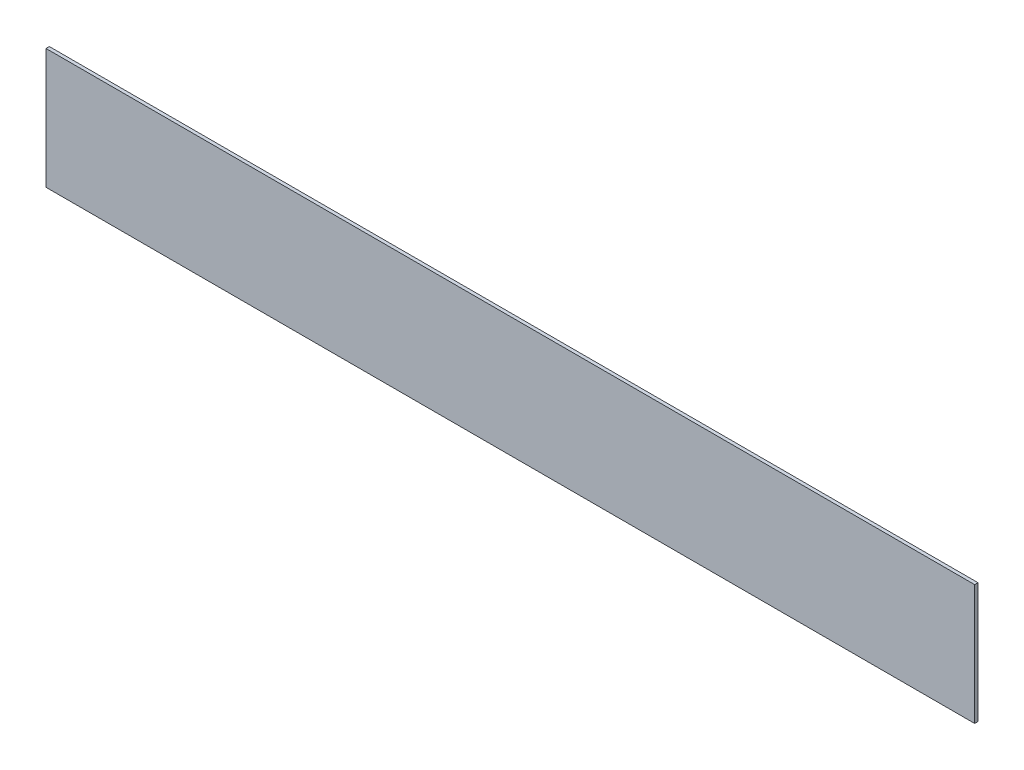
ISO-10303-21;
HEADER;
FILE_DESCRIPTION(('STEP AP214'),'2;1');
FILE_NAME('part.step','',(''),(''),'','','');
FILE_SCHEMA(('AUTOMOTIVE_DESIGN { 1 0 10303 214 1 1 1 1 }'));
ENDSEC;
DATA;
#1=APPLICATION_CONTEXT('core data for automotive mechanical design processes');
#2=APPLICATION_PROTOCOL_DEFINITION('international standard','automotive_design',2000,#1);
#3=PRODUCT_CONTEXT('',#1,'mechanical');
#4=PRODUCT('Part','Part','',(#3));
#5=PRODUCT_RELATED_PRODUCT_CATEGORY('part','',(#4));
#6=PRODUCT_DEFINITION_FORMATION('','',#4);
#7=PRODUCT_DEFINITION_CONTEXT('part definition',#1,'design');
#8=PRODUCT_DEFINITION('design','',#6,#7);
#9=PRODUCT_DEFINITION_SHAPE('','',#8);
#10=(LENGTH_UNIT() NAMED_UNIT(*) SI_UNIT(.MILLI.,.METRE.));
#11=(NAMED_UNIT(*) PLANE_ANGLE_UNIT() SI_UNIT($,.RADIAN.));
#12=(NAMED_UNIT(*) SI_UNIT($,.STERADIAN.) SOLID_ANGLE_UNIT());
#13=UNCERTAINTY_MEASURE_WITH_UNIT(LENGTH_MEASURE(1.E-05),#10,'distance_accuracy_value','');
#14=(GEOMETRIC_REPRESENTATION_CONTEXT(3) GLOBAL_UNCERTAINTY_ASSIGNED_CONTEXT((#13)) GLOBAL_UNIT_ASSIGNED_CONTEXT((#10,
#11,#12)) REPRESENTATION_CONTEXT('',''));
#15=CARTESIAN_POINT('',(0.,0.,0.));
#16=DIRECTION('',(0.,0.,1.));
#17=DIRECTION('',(1.,0.,0.));
#18=AXIS2_PLACEMENT_3D('',#15,#16,#17);
#19=CARTESIAN_POINT('',(0.,0.,25.4));
#20=DIRECTION('',(1.,0.,0.));
#21=DIRECTION('',(0.,1.,0.));
#22=AXIS2_PLACEMENT_3D('',#19,#20,#21);
#23=PLANE('',#22);
#24=DIRECTION('',(0.,-1.,0.));
#25=VECTOR('',#24,1.);
#26=CARTESIAN_POINT('',(0.,0.,0.));
#27=LINE('',#26,#25);
#28=CARTESIAN_POINT('',(0.,0.,0.));
#29=VERTEX_POINT('',#28);
#30=CARTESIAN_POINT('',(1.11981703314034E-13,-914.4,0.));
#31=VERTEX_POINT('',#30);
#32=EDGE_CURVE('E100',#29,#31,#27,.T.);
#33=ORIENTED_EDGE('',*,*,#32,.T.);
#34=DIRECTION('',(0.,0.,-1.));
#35=VECTOR('',#34,1.);
#36=CARTESIAN_POINT('',(1.11981703314034E-13,-914.4,25.4));
#37=LINE('',#36,#35);
#38=CARTESIAN_POINT('',(1.11981703314034E-13,-914.4,25.4));
#39=VERTEX_POINT('',#38);
#40=EDGE_CURVE('E11',#39,#31,#37,.T.);
#41=ORIENTED_EDGE('',*,*,#40,.F.);
#42=DIRECTION('',(0.,-1.,0.));
#43=VECTOR('',#42,1.);
#44=CARTESIAN_POINT('',(0.,0.,25.4));
#45=LINE('',#44,#43);
#46=CARTESIAN_POINT('',(0.,0.,25.4));
#47=VERTEX_POINT('',#46);
#48=EDGE_CURVE('E88',#47,#39,#45,.T.);
#49=ORIENTED_EDGE('',*,*,#48,.F.);
#50=DIRECTION('',(0.,0.,-1.));
#51=VECTOR('',#50,1.);
#52=CARTESIAN_POINT('',(0.,0.,25.4));
#53=LINE('',#52,#51);
#54=EDGE_CURVE('E96',#47,#29,#53,.T.);
#55=ORIENTED_EDGE('',*,*,#54,.T.);
#56=EDGE_LOOP('',(#33,#41,#49,#55));
#57=FACE_BOUND('',#56,.T.);
#58=ADVANCED_FACE('F37',(#57),#23,.F.);
#59=CARTESIAN_POINT('',(1.11981703314034E-13,-914.4,25.4));
#60=DIRECTION('',(0.,1.,0.));
#61=DIRECTION('',(0.,0.,1.));
#62=AXIS2_PLACEMENT_3D('',#59,#60,#61);
#63=PLANE('',#62);
#64=DIRECTION('',(1.,0.,0.));
#65=VECTOR('',#64,1.);
#66=CARTESIAN_POINT('',(1.11981703314034E-13,-914.4,0.));
#67=LINE('',#66,#65);
#68=CARTESIAN_POINT('',(7061.2,-914.4,0.));
#69=VERTEX_POINT('',#68);
#70=EDGE_CURVE('E92',#31,#69,#67,.T.);
#71=ORIENTED_EDGE('',*,*,#70,.T.);
#72=DIRECTION('',(0.,0.,-1.));
#73=VECTOR('',#72,1.);
#74=CARTESIAN_POINT('',(7061.2,-914.4,25.4));
#75=LINE('',#74,#73);
#76=CARTESIAN_POINT('',(7061.2,-914.4,25.4));
#77=VERTEX_POINT('',#76);
#78=EDGE_CURVE('E45',#77,#69,#75,.T.);
#79=ORIENTED_EDGE('',*,*,#78,.F.);
#80=DIRECTION('',(1.,0.,0.));
#81=VECTOR('',#80,1.);
#82=CARTESIAN_POINT('',(1.11981703314034E-13,-914.4,25.4));
#83=LINE('',#82,#81);
#84=EDGE_CURVE('E83',#39,#77,#83,.T.);
#85=ORIENTED_EDGE('',*,*,#84,.F.);
#86=ORIENTED_EDGE('',*,*,#40,.T.);
#87=EDGE_LOOP('',(#71,#79,#85,#86));
#88=FACE_BOUND('',#87,.T.);
#89=ADVANCED_FACE('F91',(#88),#63,.F.);
#90=CARTESIAN_POINT('',(7061.2,0.,25.4));
#91=DIRECTION('',(-1.,0.,0.));
#92=DIRECTION('',(0.,0.,1.));
#93=AXIS2_PLACEMENT_3D('',#90,#91,#92);
#94=PLANE('',#93);
#95=DIRECTION('',(0.,1.,0.));
#96=VECTOR('',#95,1.);
#97=CARTESIAN_POINT('',(7061.2,0.,0.));
#98=LINE('',#97,#96);
#99=CARTESIAN_POINT('',(7061.2,0.,0.));
#100=VERTEX_POINT('',#99);
#101=EDGE_CURVE('E70',#69,#100,#98,.T.);
#102=ORIENTED_EDGE('',*,*,#101,.T.);
#103=DIRECTION('',(0.,0.,-1.));
#104=VECTOR('',#103,1.);
#105=CARTESIAN_POINT('',(7061.2,0.,25.4));
#106=LINE('',#105,#104);
#107=CARTESIAN_POINT('',(7061.2,0.,25.4));
#108=VERTEX_POINT('',#107);
#109=EDGE_CURVE('E93',#108,#100,#106,.T.);
#110=ORIENTED_EDGE('',*,*,#109,.F.);
#111=DIRECTION('',(0.,1.,0.));
#112=VECTOR('',#111,1.);
#113=CARTESIAN_POINT('',(7061.2,0.,25.4));
#114=LINE('',#113,#112);
#115=EDGE_CURVE('E86',#77,#108,#114,.T.);
#116=ORIENTED_EDGE('',*,*,#115,.F.);
#117=ORIENTED_EDGE('',*,*,#78,.T.);
#118=EDGE_LOOP('',(#102,#110,#116,#117));
#119=FACE_BOUND('',#118,.T.);
#120=ADVANCED_FACE('F94',(#119),#94,.F.);
#121=CARTESIAN_POINT('',(0.,0.,25.4));
#122=DIRECTION('',(0.,-1.,0.));
#123=DIRECTION('',(0.,0.,-1.));
#124=AXIS2_PLACEMENT_3D('',#121,#122,#123);
#125=PLANE('',#124);
#126=DIRECTION('',(-1.,0.,0.));
#127=VECTOR('',#126,1.);
#128=CARTESIAN_POINT('',(0.,0.,0.));
#129=LINE('',#128,#127);
#130=EDGE_CURVE('E76',#100,#29,#129,.T.);
#131=ORIENTED_EDGE('',*,*,#130,.T.);
#132=ORIENTED_EDGE('',*,*,#54,.F.);
#133=DIRECTION('',(-1.,0.,0.));
#134=VECTOR('',#133,1.);
#135=CARTESIAN_POINT('',(0.,0.,25.4));
#136=LINE('',#135,#134);
#137=EDGE_CURVE('E53',#108,#47,#136,.T.);
#138=ORIENTED_EDGE('',*,*,#137,.F.);
#139=ORIENTED_EDGE('',*,*,#109,.T.);
#140=EDGE_LOOP('',(#131,#132,#138,#139));
#141=FACE_BOUND('',#140,.T.);
#142=ADVANCED_FACE('F107',(#141),#125,.F.);
#143=CARTESIAN_POINT('',(0.,0.,25.4));
#144=DIRECTION('',(0.,0.,1.));
#145=DIRECTION('',(1.,0.,0.));
#146=AXIS2_PLACEMENT_3D('',#143,#144,#145);
#147=PLANE('',#146);
#148=ORIENTED_EDGE('',*,*,#48,.T.);
#149=ORIENTED_EDGE('',*,*,#84,.T.);
#150=ORIENTED_EDGE('',*,*,#115,.T.);
#151=ORIENTED_EDGE('',*,*,#137,.T.);
#152=EDGE_LOOP('',(#148,#149,#150,#151));
#153=FACE_BOUND('',#152,.T.);
#154=ADVANCED_FACE('F84',(#153),#147,.T.);
#155=CARTESIAN_POINT('',(0.,0.,0.));
#156=DIRECTION('',(0.,0.,1.));
#157=DIRECTION('',(1.,0.,0.));
#158=AXIS2_PLACEMENT_3D('',#155,#156,#157);
#159=PLANE('',#158);
#160=ORIENTED_EDGE('',*,*,#32,.F.);
#161=ORIENTED_EDGE('',*,*,#130,.F.);
#162=ORIENTED_EDGE('',*,*,#101,.F.);
#163=ORIENTED_EDGE('',*,*,#70,.F.);
#164=EDGE_LOOP('',(#160,#161,#162,#163));
#165=FACE_BOUND('',#164,.T.);
#166=ADVANCED_FACE('F110',(#165),#159,.F.);
#167=CLOSED_SHELL('',(#58,#89,#120,#142,#154,#166));
#168=MANIFOLD_SOLID_BREP('B2',#167);
#169=ADVANCED_BREP_SHAPE_REPRESENTATION('',(#18,#168),#14);
#170=SHAPE_DEFINITION_REPRESENTATION(#9,#169);
ENDSEC;
END-ISO-10303-21;
